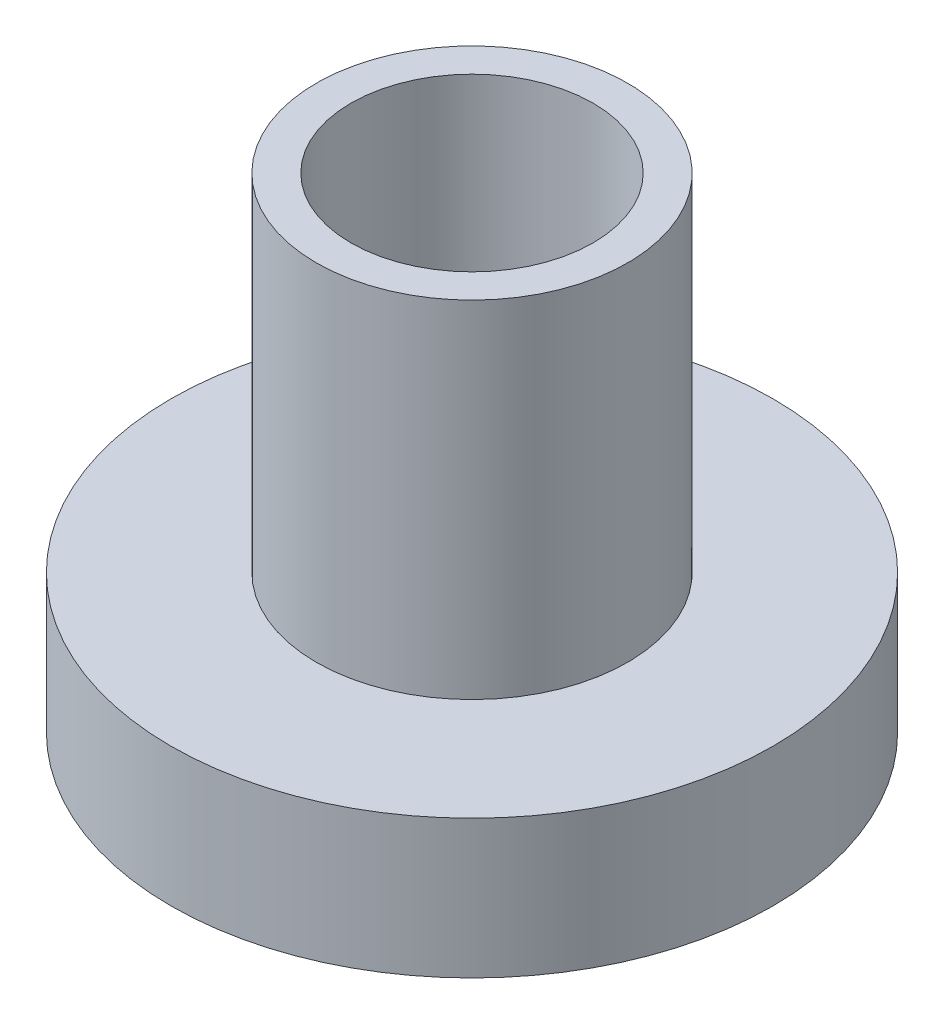
ISO-10303-21;
HEADER;
FILE_DESCRIPTION(('STEP AP214'),'2;1');
FILE_NAME('part.step','',(''),(''),'','','');
FILE_SCHEMA(('AUTOMOTIVE_DESIGN { 1 0 10303 214 1 1 1 1 }'));
ENDSEC;
DATA;
#1=APPLICATION_CONTEXT('core data for automotive mechanical design processes');
#2=APPLICATION_PROTOCOL_DEFINITION('international standard','automotive_design',2000,#1);
#3=PRODUCT_CONTEXT('',#1,'mechanical');
#4=PRODUCT('Part','Part','',(#3));
#5=PRODUCT_RELATED_PRODUCT_CATEGORY('part','',(#4));
#6=PRODUCT_DEFINITION_FORMATION('','',#4);
#7=PRODUCT_DEFINITION_CONTEXT('part definition',#1,'design');
#8=PRODUCT_DEFINITION('design','',#6,#7);
#9=PRODUCT_DEFINITION_SHAPE('','',#8);
#10=(LENGTH_UNIT() NAMED_UNIT(*) SI_UNIT(.MILLI.,.METRE.));
#11=(NAMED_UNIT(*) PLANE_ANGLE_UNIT() SI_UNIT($,.RADIAN.));
#12=(NAMED_UNIT(*) SI_UNIT($,.STERADIAN.) SOLID_ANGLE_UNIT());
#13=UNCERTAINTY_MEASURE_WITH_UNIT(LENGTH_MEASURE(1.E-05),#10,'distance_accuracy_value','');
#14=(GEOMETRIC_REPRESENTATION_CONTEXT(3) GLOBAL_UNCERTAINTY_ASSIGNED_CONTEXT((#13)) GLOBAL_UNIT_ASSIGNED_CONTEXT((#10,
#11,#12)) REPRESENTATION_CONTEXT('',''));
#15=CARTESIAN_POINT('',(0.,0.,0.));
#16=DIRECTION('',(0.,0.,1.));
#17=DIRECTION('',(1.,0.,0.));
#18=AXIS2_PLACEMENT_3D('',#15,#16,#17);
#19=CARTESIAN_POINT('',(0.,2.,0.));
#20=DIRECTION('',(0.,-1.,0.));
#21=DIRECTION('',(0.,0.,-1.));
#22=AXIS2_PLACEMENT_3D('',#19,#20,#21);
#23=CYLINDRICAL_SURFACE('',#22,4.35);
#24=CARTESIAN_POINT('',(0.,2.,0.));
#25=DIRECTION('',(0.,1.,0.));
#26=DIRECTION('',(0.,0.,1.));
#27=AXIS2_PLACEMENT_3D('',#24,#25,#26);
#28=CIRCLE('',#27,4.35);
#29=CARTESIAN_POINT('',(0.,2.,4.35));
#30=VERTEX_POINT('',#29);
#31=EDGE_CURVE('E49',#30,#30,#28,.T.);
#32=ORIENTED_EDGE('',*,*,#31,.F.);
#33=EDGE_LOOP('',(#32));
#34=FACE_BOUND('',#33,.T.);
#35=CARTESIAN_POINT('',(0.,0.,0.));
#36=DIRECTION('',(0.,1.,0.));
#37=DIRECTION('',(0.,0.,1.));
#38=AXIS2_PLACEMENT_3D('',#35,#36,#37);
#39=CIRCLE('',#38,4.35);
#40=CARTESIAN_POINT('',(0.,0.,4.35));
#41=VERTEX_POINT('',#40);
#42=EDGE_CURVE('E44',#41,#41,#39,.T.);
#43=ORIENTED_EDGE('',*,*,#42,.T.);
#44=EDGE_LOOP('',(#43));
#45=FACE_BOUND('',#44,.T.);
#46=ADVANCED_FACE('F41',(#34,#45),#23,.T.);
#47=CARTESIAN_POINT('',(0.,2.,0.));
#48=DIRECTION('',(0.,1.,0.));
#49=DIRECTION('',(0.,0.,1.));
#50=AXIS2_PLACEMENT_3D('',#47,#48,#49);
#51=PLANE('',#50);
#52=CARTESIAN_POINT('',(0.,2.,0.));
#53=DIRECTION('',(0.,1.,0.));
#54=DIRECTION('',(0.,0.,1.));
#55=AXIS2_PLACEMENT_3D('',#52,#53,#54);
#56=CIRCLE('',#55,2.25);
#57=CARTESIAN_POINT('',(0.,2.,2.25));
#58=VERTEX_POINT('',#57);
#59=EDGE_CURVE('E10',#58,#58,#56,.T.);
#60=ORIENTED_EDGE('',*,*,#59,.F.);
#61=EDGE_LOOP('',(#60));
#62=FACE_BOUND('',#61,.T.);
#63=ORIENTED_EDGE('',*,*,#31,.T.);
#64=EDGE_LOOP('',(#63));
#65=FACE_BOUND('',#64,.T.);
#66=ADVANCED_FACE('F90',(#62,#65),#51,.T.);
#67=CARTESIAN_POINT('',(0.,0.,0.));
#68=DIRECTION('',(0.,1.,0.));
#69=DIRECTION('',(0.,0.,1.));
#70=AXIS2_PLACEMENT_3D('',#67,#68,#69);
#71=PLANE('',#70);
#72=CARTESIAN_POINT('',(0.,0.,0.));
#73=DIRECTION('',(0.,1.,0.));
#74=DIRECTION('',(0.,0.,1.));
#75=AXIS2_PLACEMENT_3D('',#72,#73,#74);
#76=CIRCLE('',#75,1.75);
#77=CARTESIAN_POINT('',(0.,0.,1.75));
#78=VERTEX_POINT('',#77);
#79=EDGE_CURVE('E60',#78,#78,#76,.T.);
#80=ORIENTED_EDGE('',*,*,#79,.T.);
#81=EDGE_LOOP('',(#80));
#82=FACE_BOUND('',#81,.T.);
#83=ORIENTED_EDGE('',*,*,#42,.F.);
#84=EDGE_LOOP('',(#83));
#85=FACE_BOUND('',#84,.T.);
#86=ADVANCED_FACE('F69',(#82,#85),#71,.F.);
#87=CARTESIAN_POINT('',(0.,7.,0.));
#88=DIRECTION('',(0.,-1.,0.));
#89=DIRECTION('',(0.,0.,-1.));
#90=AXIS2_PLACEMENT_3D('',#87,#88,#89);
#91=CYLINDRICAL_SURFACE('',#90,2.25);
#92=CARTESIAN_POINT('',(0.,7.,0.));
#93=DIRECTION('',(0.,1.,0.));
#94=DIRECTION('',(0.,0.,1.));
#95=AXIS2_PLACEMENT_3D('',#92,#93,#94);
#96=CIRCLE('',#95,2.25);
#97=CARTESIAN_POINT('',(0.,7.,2.25));
#98=VERTEX_POINT('',#97);
#99=EDGE_CURVE('E56',#98,#98,#96,.T.);
#100=ORIENTED_EDGE('',*,*,#99,.F.);
#101=EDGE_LOOP('',(#100));
#102=FACE_BOUND('',#101,.T.);
#103=ORIENTED_EDGE('',*,*,#59,.T.);
#104=EDGE_LOOP('',(#103));
#105=FACE_BOUND('',#104,.T.);
#106=ADVANCED_FACE('F81',(#102,#105),#91,.T.);
#107=CARTESIAN_POINT('',(0.,7.,0.));
#108=DIRECTION('',(0.,1.,0.));
#109=DIRECTION('',(0.,0.,1.));
#110=AXIS2_PLACEMENT_3D('',#107,#108,#109);
#111=PLANE('',#110);
#112=CARTESIAN_POINT('',(0.,7.,0.));
#113=DIRECTION('',(0.,1.,0.));
#114=DIRECTION('',(0.,0.,1.));
#115=AXIS2_PLACEMENT_3D('',#112,#113,#114);
#116=CIRCLE('',#115,1.75);
#117=CARTESIAN_POINT('',(0.,7.,1.75));
#118=VERTEX_POINT('',#117);
#119=EDGE_CURVE('E61',#118,#118,#116,.T.);
#120=ORIENTED_EDGE('',*,*,#119,.F.);
#121=EDGE_LOOP('',(#120));
#122=FACE_BOUND('',#121,.T.);
#123=ORIENTED_EDGE('',*,*,#99,.T.);
#124=EDGE_LOOP('',(#123));
#125=FACE_BOUND('',#124,.T.);
#126=ADVANCED_FACE('F75',(#122,#125),#111,.T.);
#127=CARTESIAN_POINT('',(0.,0.,0.));
#128=DIRECTION('',(0.,1.,0.));
#129=DIRECTION('',(0.,0.,1.));
#130=AXIS2_PLACEMENT_3D('',#127,#128,#129);
#131=CYLINDRICAL_SURFACE('',#130,1.75);
#132=ORIENTED_EDGE('',*,*,#79,.F.);
#133=EDGE_LOOP('',(#132));
#134=FACE_BOUND('',#133,.T.);
#135=ORIENTED_EDGE('',*,*,#119,.T.);
#136=EDGE_LOOP('',(#135));
#137=FACE_BOUND('',#136,.T.);
#138=ADVANCED_FACE('F72',(#134,#137),#131,.F.);
#139=CLOSED_SHELL('',(#46,#66,#86,#106,#126,#138));
#140=MANIFOLD_SOLID_BREP('B2',#139);
#141=ADVANCED_BREP_SHAPE_REPRESENTATION('',(#18,#140),#14);
#142=SHAPE_DEFINITION_REPRESENTATION(#9,#141);
ENDSEC;
END-ISO-10303-21;
